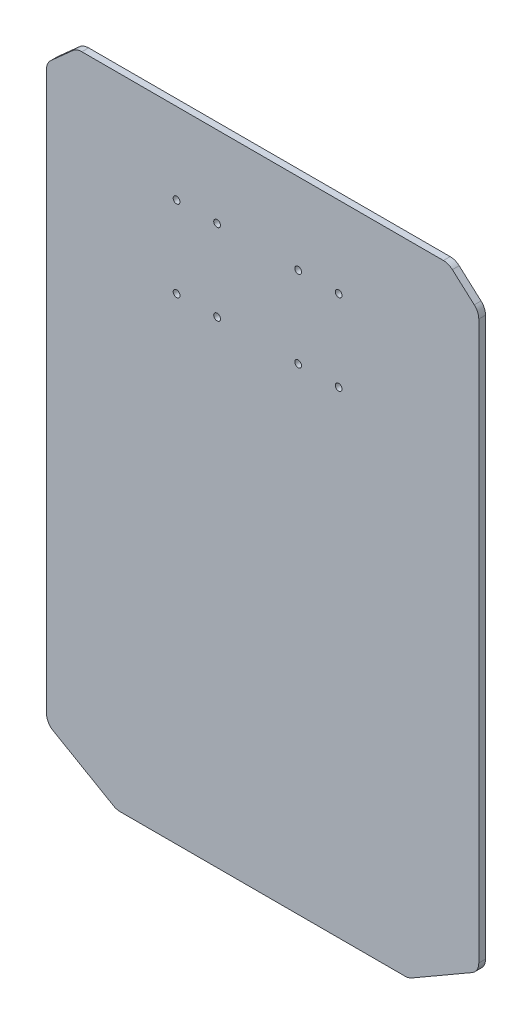
ISO-10303-21;
HEADER;
FILE_DESCRIPTION(('STEP AP214'),'2;1');
FILE_NAME('part.step','',(''),(''),'','','');
FILE_SCHEMA(('AUTOMOTIVE_DESIGN { 1 0 10303 214 1 1 1 1 }'));
ENDSEC;
DATA;
#1=APPLICATION_CONTEXT('core data for automotive mechanical design processes');
#2=APPLICATION_PROTOCOL_DEFINITION('international standard','automotive_design',2000,#1);
#3=PRODUCT_CONTEXT('',#1,'mechanical');
#4=PRODUCT('Part','Part','',(#3));
#5=PRODUCT_RELATED_PRODUCT_CATEGORY('part','',(#4));
#6=PRODUCT_DEFINITION_FORMATION('','',#4);
#7=PRODUCT_DEFINITION_CONTEXT('part definition',#1,'design');
#8=PRODUCT_DEFINITION('design','',#6,#7);
#9=PRODUCT_DEFINITION_SHAPE('','',#8);
#10=(LENGTH_UNIT() NAMED_UNIT(*) SI_UNIT(.MILLI.,.METRE.));
#11=(NAMED_UNIT(*) PLANE_ANGLE_UNIT() SI_UNIT($,.RADIAN.));
#12=(NAMED_UNIT(*) SI_UNIT($,.STERADIAN.) SOLID_ANGLE_UNIT());
#13=UNCERTAINTY_MEASURE_WITH_UNIT(LENGTH_MEASURE(1.E-05),#10,'distance_accuracy_value','');
#14=(GEOMETRIC_REPRESENTATION_CONTEXT(3) GLOBAL_UNCERTAINTY_ASSIGNED_CONTEXT((#13)) GLOBAL_UNIT_ASSIGNED_CONTEXT((#10,
#11,#12)) REPRESENTATION_CONTEXT('',''));
#15=CARTESIAN_POINT('',(0.,0.,0.));
#16=DIRECTION('',(0.,0.,1.));
#17=DIRECTION('',(1.,0.,0.));
#18=AXIS2_PLACEMENT_3D('',#15,#16,#17);
#19=CARTESIAN_POINT('',(163.695072606206,0.,5.));
#20=DIRECTION('',(1.,0.,0.));
#21=DIRECTION('',(0.,1.,0.));
#22=AXIS2_PLACEMENT_3D('',#19,#20,#21);
#23=PLANE('',#22);
#24=DIRECTION('',(0.,-1.,0.));
#25=VECTOR('',#24,1.);
#26=CARTESIAN_POINT('',(163.695072606206,0.,5.));
#27=LINE('',#26,#25);
#28=CARTESIAN_POINT('',(163.695072606206,212.027864045001,5.));
#29=VERTEX_POINT('',#28);
#30=CARTESIAN_POINT('',(163.695072606206,-200.726497308103,5.));
#31=VERTEX_POINT('',#30);
#32=EDGE_CURVE('E278',#29,#31,#27,.T.);
#33=ORIENTED_EDGE('',*,*,#32,.T.);
#34=DIRECTION('',(0.,0.,1.));
#35=VECTOR('',#34,1.);
#36=CARTESIAN_POINT('',(163.695072606206,-200.726497308103,0.));
#37=LINE('',#36,#35);
#38=CARTESIAN_POINT('',(163.695072606206,-200.726497308103,0.));
#39=VERTEX_POINT('',#38);
#40=EDGE_CURVE('E254',#31,#39,#37,.F.);
#41=ORIENTED_EDGE('',*,*,#40,.T.);
#42=DIRECTION('',(0.,-1.,0.));
#43=VECTOR('',#42,1.);
#44=CARTESIAN_POINT('',(163.695072606206,0.,0.));
#45=LINE('',#44,#43);
#46=CARTESIAN_POINT('',(163.695072606206,212.027864045001,0.));
#47=VERTEX_POINT('',#46);
#48=EDGE_CURVE('E193',#47,#39,#45,.T.);
#49=ORIENTED_EDGE('',*,*,#48,.F.);
#50=DIRECTION('',(0.,0.,1.));
#51=VECTOR('',#50,1.);
#52=CARTESIAN_POINT('',(163.695072606206,212.027864045001,5.));
#53=LINE('',#52,#51);
#54=EDGE_CURVE('E250',#47,#29,#53,.T.);
#55=ORIENTED_EDGE('',*,*,#54,.T.);
#56=EDGE_LOOP('',(#33,#41,#49,#55));
#57=FACE_BOUND('',#56,.T.);
#58=ADVANCED_FACE('F17',(#57),#23,.T.);
#59=CARTESIAN_POINT('',(3.69507260620591,236.5,5.));
#60=DIRECTION('',(0.,-1.,0.));
#61=DIRECTION('',(1.,0.,0.));
#62=AXIS2_PLACEMENT_3D('',#59,#60,#61);
#63=PLANE('',#62);
#64=DIRECTION('',(-1.,0.,0.));
#65=VECTOR('',#64,1.);
#66=CARTESIAN_POINT('',(3.69507260620591,236.5,0.));
#67=LINE('',#66,#65);
#68=CARTESIAN_POINT('',(137.514732718707,236.5,0.));
#69=VERTEX_POINT('',#68);
#70=CARTESIAN_POINT('',(-130.124587506295,236.5,0.));
#71=VERTEX_POINT('',#70);
#72=EDGE_CURVE('E174',#69,#71,#67,.T.);
#73=ORIENTED_EDGE('',*,*,#72,.T.);
#74=DIRECTION('',(0.,0.,1.));
#75=VECTOR('',#74,1.);
#76=CARTESIAN_POINT('',(-130.124587506295,236.5,5.));
#77=LINE('',#76,#75);
#78=CARTESIAN_POINT('',(-130.124587506295,236.5,5.));
#79=VERTEX_POINT('',#78);
#80=EDGE_CURVE('E181',#71,#79,#77,.T.);
#81=ORIENTED_EDGE('',*,*,#80,.T.);
#82=DIRECTION('',(-1.,0.,0.));
#83=VECTOR('',#82,1.);
#84=CARTESIAN_POINT('',(3.69507260620591,236.5,5.));
#85=LINE('',#84,#83);
#86=CARTESIAN_POINT('',(137.514732718707,236.5,5.));
#87=VERTEX_POINT('',#86);
#88=EDGE_CURVE('E177',#87,#79,#85,.T.);
#89=ORIENTED_EDGE('',*,*,#88,.F.);
#90=DIRECTION('',(0.,0.,1.));
#91=VECTOR('',#90,1.);
#92=CARTESIAN_POINT('',(137.514732718707,236.5,0.));
#93=LINE('',#92,#91);
#94=EDGE_CURVE('E170',#87,#69,#93,.F.);
#95=ORIENTED_EDGE('',*,*,#94,.T.);
#96=EDGE_LOOP('',(#73,#81,#89,#95));
#97=FACE_BOUND('',#96,.T.);
#98=ADVANCED_FACE('F172',(#97),#63,.F.);
#99=CARTESIAN_POINT('',(-156.304927393794,0.,5.));
#100=DIRECTION('',(1.,0.,0.));
#101=DIRECTION('',(0.,1.,0.));
#102=AXIS2_PLACEMENT_3D('',#99,#100,#101);
#103=PLANE('',#102);
#104=DIRECTION('',(0.,-1.,0.));
#105=VECTOR('',#104,1.);
#106=CARTESIAN_POINT('',(-156.304927393794,0.,5.));
#107=LINE('',#106,#105);
#108=CARTESIAN_POINT('',(-156.304927393794,212.027864045001,5.));
#109=VERTEX_POINT('',#108);
#110=CARTESIAN_POINT('',(-156.304927393794,-200.726497308104,5.));
#111=VERTEX_POINT('',#110);
#112=EDGE_CURVE('E291',#109,#111,#107,.T.);
#113=ORIENTED_EDGE('',*,*,#112,.F.);
#114=DIRECTION('',(0.,0.,1.));
#115=VECTOR('',#114,1.);
#116=CARTESIAN_POINT('',(-156.304927393794,212.027864045001,5.));
#117=LINE('',#116,#115);
#118=CARTESIAN_POINT('',(-156.304927393794,212.027864045001,0.));
#119=VERTEX_POINT('',#118);
#120=EDGE_CURVE('E227',#109,#119,#117,.F.);
#121=ORIENTED_EDGE('',*,*,#120,.T.);
#122=DIRECTION('',(0.,-1.,0.));
#123=VECTOR('',#122,1.);
#124=CARTESIAN_POINT('',(-156.304927393794,0.,0.));
#125=LINE('',#124,#123);
#126=CARTESIAN_POINT('',(-156.304927393794,-200.726497308104,0.));
#127=VERTEX_POINT('',#126);
#128=EDGE_CURVE('E192',#119,#127,#125,.T.);
#129=ORIENTED_EDGE('',*,*,#128,.T.);
#130=DIRECTION('',(0.,0.,1.));
#131=VECTOR('',#130,1.);
#132=CARTESIAN_POINT('',(-156.304927393794,-200.726497308104,5.));
#133=LINE('',#132,#131);
#134=EDGE_CURVE('E223',#127,#111,#133,.T.);
#135=ORIENTED_EDGE('',*,*,#134,.T.);
#136=EDGE_LOOP('',(#113,#121,#129,#135));
#137=FACE_BOUND('',#136,.T.);
#138=ADVANCED_FACE('F480',(#137),#103,.F.);
#139=CARTESIAN_POINT('',(3.69507260620591,-236.5,5.));
#140=DIRECTION('',(0.,-1.,0.));
#141=DIRECTION('',(1.,0.,0.));
#142=AXIS2_PLACEMENT_3D('',#139,#140,#141);
#143=PLANE('',#142);
#144=DIRECTION('',(-1.,0.,0.));
#145=VECTOR('',#144,1.);
#146=CARTESIAN_POINT('',(3.69507260620591,-236.5,5.));
#147=LINE('',#146,#145);
#148=CARTESIAN_POINT('',(109.054056454828,-236.5,5.));
#149=VERTEX_POINT('',#148);
#150=CARTESIAN_POINT('',(-101.663911242416,-236.5,5.));
#151=VERTEX_POINT('',#150);
#152=EDGE_CURVE('E271',#149,#151,#147,.T.);
#153=ORIENTED_EDGE('',*,*,#152,.T.);
#154=DIRECTION('',(0.,0.,1.));
#155=VECTOR('',#154,1.);
#156=CARTESIAN_POINT('',(-101.663911242416,-236.5,5.));
#157=LINE('',#156,#155);
#158=CARTESIAN_POINT('',(-101.663911242416,-236.5,0.));
#159=VERTEX_POINT('',#158);
#160=EDGE_CURVE('E240',#151,#159,#157,.F.);
#161=ORIENTED_EDGE('',*,*,#160,.T.);
#162=DIRECTION('',(-1.,0.,0.));
#163=VECTOR('',#162,1.);
#164=CARTESIAN_POINT('',(3.69507260620591,-236.5,0.));
#165=LINE('',#164,#163);
#166=CARTESIAN_POINT('',(109.054056454828,-236.5,0.));
#167=VERTEX_POINT('',#166);
#168=EDGE_CURVE('E285',#167,#159,#165,.T.);
#169=ORIENTED_EDGE('',*,*,#168,.F.);
#170=DIRECTION('',(0.,0.,1.));
#171=VECTOR('',#170,1.);
#172=CARTESIAN_POINT('',(109.054056454828,-236.5,5.));
#173=LINE('',#172,#171);
#174=EDGE_CURVE('E236',#167,#149,#173,.T.);
#175=ORIENTED_EDGE('',*,*,#174,.T.);
#176=EDGE_LOOP('',(#153,#161,#169,#175));
#177=FACE_BOUND('',#176,.T.);
#178=ADVANCED_FACE('F452',(#177),#143,.T.);
#179=CARTESIAN_POINT('',(3.69507260620589,0.,5.));
#180=DIRECTION('',(0.,0.,1.));
#181=DIRECTION('',(1.,0.,0.));
#182=AXIS2_PLACEMENT_3D('',#179,#180,#181);
#183=PLANE('',#182);
#184=CARTESIAN_POINT('',(-60.,176.5,5.));
#185=DIRECTION('',(0.,0.,1.));
#186=DIRECTION('',(1.,0.,0.));
#187=AXIS2_PLACEMENT_3D('',#184,#185,#186);
#188=CIRCLE('',#187,2.5);
#189=CARTESIAN_POINT('',(-57.5,176.5,5.));
#190=VERTEX_POINT('',#189);
#191=EDGE_CURVE('E409',#190,#190,#188,.T.);
#192=ORIENTED_EDGE('',*,*,#191,.F.);
#193=EDGE_LOOP('',(#192));
#194=FACE_BOUND('',#193,.T.);
#195=CARTESIAN_POINT('',(-30.,176.5,5.));
#196=DIRECTION('',(0.,0.,1.));
#197=DIRECTION('',(1.,0.,0.));
#198=AXIS2_PLACEMENT_3D('',#195,#196,#197);
#199=CIRCLE('',#198,2.5);
#200=CARTESIAN_POINT('',(-27.5,176.5,5.));
#201=VERTEX_POINT('',#200);
#202=EDGE_CURVE('E401',#201,#201,#199,.T.);
#203=ORIENTED_EDGE('',*,*,#202,.F.);
#204=EDGE_LOOP('',(#203));
#205=FACE_BOUND('',#204,.T.);
#206=CARTESIAN_POINT('',(-30.,116.5,5.));
#207=DIRECTION('',(0.,0.,1.));
#208=DIRECTION('',(1.,0.,0.));
#209=AXIS2_PLACEMENT_3D('',#206,#207,#208);
#210=CIRCLE('',#209,2.5);
#211=CARTESIAN_POINT('',(-27.5,116.5,5.));
#212=VERTEX_POINT('',#211);
#213=EDGE_CURVE('E393',#212,#212,#210,.T.);
#214=ORIENTED_EDGE('',*,*,#213,.F.);
#215=EDGE_LOOP('',(#214));
#216=FACE_BOUND('',#215,.T.);
#217=CARTESIAN_POINT('',(30.,116.5,5.));
#218=DIRECTION('',(0.,0.,1.));
#219=DIRECTION('',(1.,0.,0.));
#220=AXIS2_PLACEMENT_3D('',#217,#218,#219);
#221=CIRCLE('',#220,2.5);
#222=CARTESIAN_POINT('',(32.5,116.5,5.));
#223=VERTEX_POINT('',#222);
#224=EDGE_CURVE('E384',#223,#223,#221,.T.);
#225=ORIENTED_EDGE('',*,*,#224,.F.);
#226=EDGE_LOOP('',(#225));
#227=FACE_BOUND('',#226,.T.);
#228=CARTESIAN_POINT('',(60.,116.5,5.));
#229=DIRECTION('',(0.,0.,1.));
#230=DIRECTION('',(1.,0.,0.));
#231=AXIS2_PLACEMENT_3D('',#228,#229,#230);
#232=CIRCLE('',#231,2.5);
#233=CARTESIAN_POINT('',(62.5,116.5,5.));
#234=VERTEX_POINT('',#233);
#235=EDGE_CURVE('E431',#234,#234,#232,.T.);
#236=ORIENTED_EDGE('',*,*,#235,.F.);
#237=EDGE_LOOP('',(#236));
#238=FACE_BOUND('',#237,.T.);
#239=CARTESIAN_POINT('',(60.,176.5,5.));
#240=DIRECTION('',(0.,0.,1.));
#241=DIRECTION('',(1.,0.,0.));
#242=AXIS2_PLACEMENT_3D('',#239,#240,#241);
#243=CIRCLE('',#242,2.5);
#244=CARTESIAN_POINT('',(62.5,176.5,5.));
#245=VERTEX_POINT('',#244);
#246=EDGE_CURVE('E423',#245,#245,#243,.T.);
#247=ORIENTED_EDGE('',*,*,#246,.F.);
#248=EDGE_LOOP('',(#247));
#249=FACE_BOUND('',#248,.T.);
#250=CARTESIAN_POINT('',(30.,176.5,5.));
#251=DIRECTION('',(0.,0.,1.));
#252=DIRECTION('',(1.,0.,0.));
#253=AXIS2_PLACEMENT_3D('',#250,#251,#252);
#254=CIRCLE('',#253,2.5);
#255=CARTESIAN_POINT('',(32.5,176.5,5.));
#256=VERTEX_POINT('',#255);
#257=EDGE_CURVE('E415',#256,#256,#254,.T.);
#258=ORIENTED_EDGE('',*,*,#257,.F.);
#259=EDGE_LOOP('',(#258));
#260=FACE_BOUND('',#259,.T.);
#261=CARTESIAN_POINT('',(-60.,116.5,5.));
#262=DIRECTION('',(0.,0.,1.));
#263=DIRECTION('',(1.,0.,0.));
#264=AXIS2_PLACEMENT_3D('',#261,#262,#263);
#265=CIRCLE('',#264,2.5);
#266=CARTESIAN_POINT('',(-57.5,116.5,5.));
#267=VERTEX_POINT('',#266);
#268=EDGE_CURVE('E370',#267,#267,#265,.T.);
#269=ORIENTED_EDGE('',*,*,#268,.F.);
#270=EDGE_LOOP('',(#269));
#271=FACE_BOUND('',#270,.T.);
#272=ORIENTED_EDGE('',*,*,#88,.T.);
#273=CARTESIAN_POINT('',(-130.124587506295,226.5,5.));
#274=DIRECTION('',(0.,0.,1.));
#275=DIRECTION('',(1.,0.,0.));
#276=AXIS2_PLACEMENT_3D('',#273,#274,#275);
#277=CIRCLE('',#276,10.);
#278=CARTESIAN_POINT('',(-136.791254172962,233.953559924999,5.));
#279=VERTEX_POINT('',#278);
#280=EDGE_CURVE('E335',#79,#279,#277,.T.);
#281=ORIENTED_EDGE('',*,*,#280,.T.);
#282=DIRECTION('',(0.745355992499931,0.666666666666666,0.));
#283=VECTOR('',#282,1.);
#284=CARTESIAN_POINT('',(-145.124587506295,226.5,5.));
#285=LINE('',#284,#283);
#286=CARTESIAN_POINT('',(-152.97159406046,219.481423969999,5.));
#287=VERTEX_POINT('',#286);
#288=EDGE_CURVE('E350',#287,#279,#285,.T.);
#289=ORIENTED_EDGE('',*,*,#288,.F.);
#290=CARTESIAN_POINT('',(-146.304927393794,212.027864045001,5.));
#291=DIRECTION('',(0.,0.,1.));
#292=DIRECTION('',(1.,0.,0.));
#293=AXIS2_PLACEMENT_3D('',#290,#291,#292);
#294=CIRCLE('',#293,10.);
#295=EDGE_CURVE('E332',#287,#109,#294,.T.);
#296=ORIENTED_EDGE('',*,*,#295,.T.);
#297=ORIENTED_EDGE('',*,*,#112,.T.);
#298=CARTESIAN_POINT('',(-146.304927393794,-200.726497308104,5.));
#299=DIRECTION('',(0.,0.,1.));
#300=DIRECTION('',(1.,0.,0.));
#301=AXIS2_PLACEMENT_3D('',#298,#299,#300);
#302=CIRCLE('',#301,10.);
#303=CARTESIAN_POINT('',(-151.304927393794,-209.386751345948,5.));
#304=VERTEX_POINT('',#303);
#305=EDGE_CURVE('E326',#111,#304,#302,.T.);
#306=ORIENTED_EDGE('',*,*,#305,.T.);
#307=DIRECTION('',(0.866025403784439,-0.5,0.));
#308=VECTOR('',#307,1.);
#309=CARTESIAN_POINT('',(-130.324165280261,-221.5,5.));
#310=LINE('',#309,#308);
#311=CARTESIAN_POINT('',(-106.663911242416,-235.160254037845,5.));
#312=VERTEX_POINT('',#311);
#313=EDGE_CURVE('E362',#304,#312,#310,.T.);
#314=ORIENTED_EDGE('',*,*,#313,.T.);
#315=CARTESIAN_POINT('',(-101.663911242416,-226.5,5.));
#316=DIRECTION('',(0.,0.,1.));
#317=DIRECTION('',(1.,0.,0.));
#318=AXIS2_PLACEMENT_3D('',#315,#316,#317);
#319=CIRCLE('',#318,10.);
#320=EDGE_CURVE('E329',#312,#151,#319,.T.);
#321=ORIENTED_EDGE('',*,*,#320,.T.);
#322=ORIENTED_EDGE('',*,*,#152,.F.);
#323=CARTESIAN_POINT('',(109.054056454828,-226.5,5.));
#324=DIRECTION('',(0.,0.,1.));
#325=DIRECTION('',(1.,0.,0.));
#326=AXIS2_PLACEMENT_3D('',#323,#324,#325);
#327=CIRCLE('',#326,10.);
#328=CARTESIAN_POINT('',(114.054056454828,-235.160254037845,5.));
#329=VERTEX_POINT('',#328);
#330=EDGE_CURVE('E321',#149,#329,#327,.T.);
#331=ORIENTED_EDGE('',*,*,#330,.T.);
#332=DIRECTION('',(-0.866025403784439,-0.5,0.));
#333=VECTOR('',#332,1.);
#334=CARTESIAN_POINT('',(137.714310492673,-221.5,5.));
#335=LINE('',#334,#333);
#336=CARTESIAN_POINT('',(158.695072606206,-209.386751345948,5.));
#337=VERTEX_POINT('',#336);
#338=EDGE_CURVE('E356',#337,#329,#335,.T.);
#339=ORIENTED_EDGE('',*,*,#338,.F.);
#340=CARTESIAN_POINT('',(153.695072606206,-200.726497308103,5.));
#341=DIRECTION('',(0.,0.,1.));
#342=DIRECTION('',(1.,0.,0.));
#343=AXIS2_PLACEMENT_3D('',#340,#341,#342);
#344=CIRCLE('',#343,10.);
#345=EDGE_CURVE('E283',#337,#31,#344,.T.);
#346=ORIENTED_EDGE('',*,*,#345,.T.);
#347=ORIENTED_EDGE('',*,*,#32,.F.);
#348=CARTESIAN_POINT('',(153.695072606206,212.027864045001,5.));
#349=DIRECTION('',(0.,0.,1.));
#350=DIRECTION('',(1.,0.,0.));
#351=AXIS2_PLACEMENT_3D('',#348,#349,#350);
#352=CIRCLE('',#351,10.);
#353=CARTESIAN_POINT('',(160.361739272873,219.48142397,5.));
#354=VERTEX_POINT('',#353);
#355=EDGE_CURVE('E274',#29,#354,#352,.T.);
#356=ORIENTED_EDGE('',*,*,#355,.T.);
#357=DIRECTION('',(-0.745355992499931,0.666666666666665,0.));
#358=VECTOR('',#357,1.);
#359=CARTESIAN_POINT('',(152.514732718707,226.5,5.));
#360=LINE('',#359,#358);
#361=CARTESIAN_POINT('',(144.181399385374,233.953559924999,5.));
#362=VERTEX_POINT('',#361);
#363=EDGE_CURVE('E264',#354,#362,#360,.T.);
#364=ORIENTED_EDGE('',*,*,#363,.T.);
#365=CARTESIAN_POINT('',(137.514732718707,226.5,5.));
#366=DIRECTION('',(0.,0.,1.));
#367=DIRECTION('',(1.,0.,0.));
#368=AXIS2_PLACEMENT_3D('',#365,#366,#367);
#369=CIRCLE('',#368,10.);
#370=EDGE_CURVE('E319',#362,#87,#369,.T.);
#371=ORIENTED_EDGE('',*,*,#370,.T.);
#372=EDGE_LOOP('',(#272,#281,#289,#296,#297,#306,#314,#321,#322,#331,#339,#346,#347,#356,#364,#371));
#373=FACE_BOUND('',#372,.T.);
#374=ADVANCED_FACE('F281',(#194,#205,#216,#227,#238,#249,#260,#271,#373),#183,.T.);
#375=CARTESIAN_POINT('',(3.69507260620589,0.,0.));
#376=DIRECTION('',(0.,0.,1.));
#377=DIRECTION('',(1.,0.,0.));
#378=AXIS2_PLACEMENT_3D('',#375,#376,#377);
#379=PLANE('',#378);
#380=CARTESIAN_POINT('',(-60.,176.5,0.));
#381=DIRECTION('',(0.,0.,1.));
#382=DIRECTION('',(1.,0.,0.));
#383=AXIS2_PLACEMENT_3D('',#380,#381,#382);
#384=CIRCLE('',#383,2.5);
#385=CARTESIAN_POINT('',(-57.5,176.5,0.));
#386=VERTEX_POINT('',#385);
#387=EDGE_CURVE('E382',#386,#386,#384,.T.);
#388=ORIENTED_EDGE('',*,*,#387,.T.);
#389=EDGE_LOOP('',(#388));
#390=FACE_BOUND('',#389,.T.);
#391=CARTESIAN_POINT('',(-30.,176.5,0.));
#392=DIRECTION('',(0.,0.,1.));
#393=DIRECTION('',(1.,0.,0.));
#394=AXIS2_PLACEMENT_3D('',#391,#392,#393);
#395=CIRCLE('',#394,2.5);
#396=CARTESIAN_POINT('',(-27.5,176.5,0.));
#397=VERTEX_POINT('',#396);
#398=EDGE_CURVE('E405',#397,#397,#395,.T.);
#399=ORIENTED_EDGE('',*,*,#398,.T.);
#400=EDGE_LOOP('',(#399));
#401=FACE_BOUND('',#400,.T.);
#402=CARTESIAN_POINT('',(-30.,116.5,0.));
#403=DIRECTION('',(0.,0.,1.));
#404=DIRECTION('',(1.,0.,0.));
#405=AXIS2_PLACEMENT_3D('',#402,#403,#404);
#406=CIRCLE('',#405,2.5);
#407=CARTESIAN_POINT('',(-27.5,116.5,0.));
#408=VERTEX_POINT('',#407);
#409=EDGE_CURVE('E397',#408,#408,#406,.T.);
#410=ORIENTED_EDGE('',*,*,#409,.T.);
#411=EDGE_LOOP('',(#410));
#412=FACE_BOUND('',#411,.T.);
#413=CARTESIAN_POINT('',(30.,116.5,0.));
#414=DIRECTION('',(0.,0.,1.));
#415=DIRECTION('',(1.,0.,0.));
#416=AXIS2_PLACEMENT_3D('',#413,#414,#415);
#417=CIRCLE('',#416,2.5);
#418=CARTESIAN_POINT('',(32.5,116.5,0.));
#419=VERTEX_POINT('',#418);
#420=EDGE_CURVE('E388',#419,#419,#417,.T.);
#421=ORIENTED_EDGE('',*,*,#420,.T.);
#422=EDGE_LOOP('',(#421));
#423=FACE_BOUND('',#422,.T.);
#424=CARTESIAN_POINT('',(60.,116.5,0.));
#425=DIRECTION('',(0.,0.,1.));
#426=DIRECTION('',(1.,0.,0.));
#427=AXIS2_PLACEMENT_3D('',#424,#425,#426);
#428=CIRCLE('',#427,2.5);
#429=CARTESIAN_POINT('',(62.5,116.5,0.));
#430=VERTEX_POINT('',#429);
#431=EDGE_CURVE('E389',#430,#430,#428,.T.);
#432=ORIENTED_EDGE('',*,*,#431,.T.);
#433=EDGE_LOOP('',(#432));
#434=FACE_BOUND('',#433,.T.);
#435=CARTESIAN_POINT('',(60.,176.5,0.));
#436=DIRECTION('',(0.,0.,1.));
#437=DIRECTION('',(1.,0.,0.));
#438=AXIS2_PLACEMENT_3D('',#435,#436,#437);
#439=CIRCLE('',#438,2.5);
#440=CARTESIAN_POINT('',(62.5,176.5,0.));
#441=VERTEX_POINT('',#440);
#442=EDGE_CURVE('E427',#441,#441,#439,.T.);
#443=ORIENTED_EDGE('',*,*,#442,.T.);
#444=EDGE_LOOP('',(#443));
#445=FACE_BOUND('',#444,.T.);
#446=CARTESIAN_POINT('',(30.,176.5,0.));
#447=DIRECTION('',(0.,0.,1.));
#448=DIRECTION('',(1.,0.,0.));
#449=AXIS2_PLACEMENT_3D('',#446,#447,#448);
#450=CIRCLE('',#449,2.5);
#451=CARTESIAN_POINT('',(32.5,176.5,0.));
#452=VERTEX_POINT('',#451);
#453=EDGE_CURVE('E419',#452,#452,#450,.T.);
#454=ORIENTED_EDGE('',*,*,#453,.T.);
#455=EDGE_LOOP('',(#454));
#456=FACE_BOUND('',#455,.T.);
#457=CARTESIAN_POINT('',(-60.,116.5,0.));
#458=DIRECTION('',(0.,0.,1.));
#459=DIRECTION('',(1.,0.,0.));
#460=AXIS2_PLACEMENT_3D('',#457,#458,#459);
#461=CIRCLE('',#460,2.5);
#462=CARTESIAN_POINT('',(-57.5,116.5,0.));
#463=VERTEX_POINT('',#462);
#464=EDGE_CURVE('E372',#463,#463,#461,.T.);
#465=ORIENTED_EDGE('',*,*,#464,.T.);
#466=EDGE_LOOP('',(#465));
#467=FACE_BOUND('',#466,.T.);
#468=DIRECTION('',(0.745355992499931,0.666666666666666,0.));
#469=VECTOR('',#468,1.);
#470=CARTESIAN_POINT('',(-174.995753422395,199.782416977771,0.));
#471=LINE('',#470,#469);
#472=CARTESIAN_POINT('',(-152.971594060461,219.48142397,0.));
#473=VERTEX_POINT('',#472);
#474=CARTESIAN_POINT('',(-136.791254172962,233.953559924999,0.));
#475=VERTEX_POINT('',#474);
#476=EDGE_CURVE('E182',#473,#475,#471,.T.);
#477=ORIENTED_EDGE('',*,*,#476,.T.);
#478=CARTESIAN_POINT('',(-130.124587506295,226.5,0.));
#479=DIRECTION('',(0.,0.,1.));
#480=DIRECTION('',(1.,0.,0.));
#481=AXIS2_PLACEMENT_3D('',#478,#479,#480);
#482=CIRCLE('',#481,10.);
#483=EDGE_CURVE('E190',#475,#71,#482,.F.);
#484=ORIENTED_EDGE('',*,*,#483,.T.);
#485=ORIENTED_EDGE('',*,*,#72,.F.);
#486=CARTESIAN_POINT('',(137.514732718707,226.5,0.));
#487=DIRECTION('',(0.,0.,1.));
#488=DIRECTION('',(1.,0.,0.));
#489=AXIS2_PLACEMENT_3D('',#486,#487,#488);
#490=CIRCLE('',#489,10.);
#491=CARTESIAN_POINT('',(144.181399385374,233.953559924999,0.));
#492=VERTEX_POINT('',#491);
#493=EDGE_CURVE('E187',#69,#492,#490,.F.);
#494=ORIENTED_EDGE('',*,*,#493,.T.);
#495=DIRECTION('',(-0.745355992499931,0.666666666666665,0.));
#496=VECTOR('',#495,1.);
#497=CARTESIAN_POINT('',(182.385898634806,199.782416977771,0.));
#498=LINE('',#497,#496);
#499=CARTESIAN_POINT('',(160.361739272873,219.48142397,0.));
#500=VERTEX_POINT('',#499);
#501=EDGE_CURVE('E262',#500,#492,#498,.T.);
#502=ORIENTED_EDGE('',*,*,#501,.F.);
#503=CARTESIAN_POINT('',(153.695072606206,212.027864045001,0.));
#504=DIRECTION('',(0.,0.,1.));
#505=DIRECTION('',(1.,0.,0.));
#506=AXIS2_PLACEMENT_3D('',#503,#504,#505);
#507=CIRCLE('',#506,10.);
#508=EDGE_CURVE('E199',#500,#47,#507,.F.);
#509=ORIENTED_EDGE('',*,*,#508,.T.);
#510=ORIENTED_EDGE('',*,*,#48,.T.);
#511=CARTESIAN_POINT('',(153.695072606206,-200.726497308103,0.));
#512=DIRECTION('',(0.,0.,1.));
#513=DIRECTION('',(1.,0.,0.));
#514=AXIS2_PLACEMENT_3D('',#511,#512,#513);
#515=CIRCLE('',#514,10.);
#516=CARTESIAN_POINT('',(158.695072606206,-209.386751345948,0.));
#517=VERTEX_POINT('',#516);
#518=EDGE_CURVE('E204',#39,#517,#515,.F.);
#519=ORIENTED_EDGE('',*,*,#518,.T.);
#520=DIRECTION('',(-0.866025403784439,-0.5,0.));
#521=VECTOR('',#520,1.);
#522=CARTESIAN_POINT('',(133.112195546949,-224.157032302755,0.));
#523=LINE('',#522,#521);
#524=CARTESIAN_POINT('',(114.054056454828,-235.160254037845,0.));
#525=VERTEX_POINT('',#524);
#526=EDGE_CURVE('E270',#517,#525,#523,.T.);
#527=ORIENTED_EDGE('',*,*,#526,.T.);
#528=CARTESIAN_POINT('',(109.054056454828,-226.5,0.));
#529=DIRECTION('',(0.,0.,1.));
#530=DIRECTION('',(1.,0.,0.));
#531=AXIS2_PLACEMENT_3D('',#528,#529,#530);
#532=CIRCLE('',#531,10.);
#533=EDGE_CURVE('E198',#525,#167,#532,.F.);
#534=ORIENTED_EDGE('',*,*,#533,.T.);
#535=ORIENTED_EDGE('',*,*,#168,.T.);
#536=CARTESIAN_POINT('',(-101.663911242416,-226.5,0.));
#537=DIRECTION('',(0.,0.,1.));
#538=DIRECTION('',(1.,0.,0.));
#539=AXIS2_PLACEMENT_3D('',#536,#537,#538);
#540=CIRCLE('',#539,10.);
#541=CARTESIAN_POINT('',(-106.663911242416,-235.160254037845,0.));
#542=VERTEX_POINT('',#541);
#543=EDGE_CURVE('E38',#159,#542,#540,.F.);
#544=ORIENTED_EDGE('',*,*,#543,.T.);
#545=DIRECTION('',(0.866025403784439,-0.5,0.));
#546=VECTOR('',#545,1.);
#547=CARTESIAN_POINT('',(-125.722050334537,-224.157032302755,0.));
#548=LINE('',#547,#546);
#549=CARTESIAN_POINT('',(-151.304927393794,-209.386751345948,0.));
#550=VERTEX_POINT('',#549);
#551=EDGE_CURVE('E310',#550,#542,#548,.T.);
#552=ORIENTED_EDGE('',*,*,#551,.F.);
#553=CARTESIAN_POINT('',(-146.304927393794,-200.726497308104,0.));
#554=DIRECTION('',(0.,0.,1.));
#555=DIRECTION('',(1.,0.,0.));
#556=AXIS2_PLACEMENT_3D('',#553,#554,#555);
#557=CIRCLE('',#556,10.);
#558=EDGE_CURVE('E213',#550,#127,#557,.F.);
#559=ORIENTED_EDGE('',*,*,#558,.T.);
#560=ORIENTED_EDGE('',*,*,#128,.F.);
#561=CARTESIAN_POINT('',(-146.304927393794,212.027864045001,0.));
#562=DIRECTION('',(0.,0.,1.));
#563=DIRECTION('',(1.,0.,0.));
#564=AXIS2_PLACEMENT_3D('',#561,#562,#563);
#565=CIRCLE('',#564,10.);
#566=EDGE_CURVE('E218',#119,#473,#565,.F.);
#567=ORIENTED_EDGE('',*,*,#566,.T.);
#568=EDGE_LOOP('',(#477,#484,#485,#494,#502,#509,#510,#519,#527,#534,#535,#544,#552,#559,#560,#567));
#569=FACE_BOUND('',#568,.T.);
#570=ADVANCED_FACE('F185',(#390,#401,#412,#423,#434,#445,#456,#467,#569),#379,.F.);
#571=CARTESIAN_POINT('',(152.514732718707,226.5,-20.));
#572=DIRECTION('',(0.666666666666665,0.745355992499931,0.));
#573=DIRECTION('',(-0.745355992499931,0.666666666666665,0.));
#574=AXIS2_PLACEMENT_3D('',#571,#572,#573);
#575=PLANE('',#574);
#576=ORIENTED_EDGE('',*,*,#501,.T.);
#577=DIRECTION('',(0.,0.,1.));
#578=VECTOR('',#577,1.);
#579=CARTESIAN_POINT('',(144.181399385374,233.953559924999,5.));
#580=LINE('',#579,#578);
#581=EDGE_CURVE('E11',#492,#362,#580,.T.);
#582=ORIENTED_EDGE('',*,*,#581,.T.);
#583=ORIENTED_EDGE('',*,*,#363,.F.);
#584=DIRECTION('',(0.,0.,1.));
#585=VECTOR('',#584,1.);
#586=CARTESIAN_POINT('',(160.361739272873,219.48142397,-20.));
#587=LINE('',#586,#585);
#588=EDGE_CURVE('E26',#354,#500,#587,.F.);
#589=ORIENTED_EDGE('',*,*,#588,.T.);
#590=EDGE_LOOP('',(#576,#582,#583,#589));
#591=FACE_BOUND('',#590,.T.);
#592=ADVANCED_FACE('F261',(#591),#575,.T.);
#593=CARTESIAN_POINT('',(137.714310492673,-221.5,-20.));
#594=DIRECTION('',(-0.5,0.866025403784439,0.));
#595=DIRECTION('',(-0.866025403784439,-0.5,0.));
#596=AXIS2_PLACEMENT_3D('',#593,#594,#595);
#597=PLANE('',#596);
#598=ORIENTED_EDGE('',*,*,#526,.F.);
#599=DIRECTION('',(0.,0.,1.));
#600=VECTOR('',#599,1.);
#601=CARTESIAN_POINT('',(158.695072606206,-209.386751345948,5.));
#602=LINE('',#601,#600);
#603=EDGE_CURVE('E246',#517,#337,#602,.T.);
#604=ORIENTED_EDGE('',*,*,#603,.T.);
#605=ORIENTED_EDGE('',*,*,#338,.T.);
#606=DIRECTION('',(0.,0.,1.));
#607=VECTOR('',#606,1.);
#608=CARTESIAN_POINT('',(114.054056454828,-235.160254037845,0.));
#609=LINE('',#608,#607);
#610=EDGE_CURVE('E243',#329,#525,#609,.F.);
#611=ORIENTED_EDGE('',*,*,#610,.T.);
#612=EDGE_LOOP('',(#598,#604,#605,#611));
#613=FACE_BOUND('',#612,.T.);
#614=ADVANCED_FACE('F699',(#613),#597,.F.);
#615=CARTESIAN_POINT('',(-130.324165280261,-221.5,-20.));
#616=DIRECTION('',(-0.5,-0.866025403784439,0.));
#617=DIRECTION('',(0.866025403784439,-0.5,0.));
#618=AXIS2_PLACEMENT_3D('',#615,#616,#617);
#619=PLANE('',#618);
#620=ORIENTED_EDGE('',*,*,#551,.T.);
#621=DIRECTION('',(0.,0.,1.));
#622=VECTOR('',#621,1.);
#623=CARTESIAN_POINT('',(-106.663911242416,-235.160254037845,-20.));
#624=LINE('',#623,#622);
#625=EDGE_CURVE('E232',#542,#312,#624,.T.);
#626=ORIENTED_EDGE('',*,*,#625,.T.);
#627=ORIENTED_EDGE('',*,*,#313,.F.);
#628=DIRECTION('',(0.,0.,1.));
#629=VECTOR('',#628,1.);
#630=CARTESIAN_POINT('',(-151.304927393794,-209.386751345948,0.));
#631=LINE('',#630,#629);
#632=EDGE_CURVE('E49',#304,#550,#631,.F.);
#633=ORIENTED_EDGE('',*,*,#632,.T.);
#634=EDGE_LOOP('',(#620,#626,#627,#633));
#635=FACE_BOUND('',#634,.T.);
#636=ADVANCED_FACE('F687',(#635),#619,.T.);
#637=CARTESIAN_POINT('',(-145.124587506295,226.5,-20.));
#638=DIRECTION('',(0.666666666666666,-0.745355992499931,0.));
#639=DIRECTION('',(0.745355992499931,0.666666666666666,0.));
#640=AXIS2_PLACEMENT_3D('',#637,#638,#639);
#641=PLANE('',#640);
#642=ORIENTED_EDGE('',*,*,#288,.T.);
#643=DIRECTION('',(0.,0.,1.));
#644=VECTOR('',#643,1.);
#645=CARTESIAN_POINT('',(-136.791254172962,233.953559924999,-20.));
#646=LINE('',#645,#644);
#647=EDGE_CURVE('E207',#279,#475,#646,.F.);
#648=ORIENTED_EDGE('',*,*,#647,.T.);
#649=ORIENTED_EDGE('',*,*,#476,.F.);
#650=DIRECTION('',(0.,0.,1.));
#651=VECTOR('',#650,1.);
#652=CARTESIAN_POINT('',(-152.97159406046,219.481423969999,-20.));
#653=LINE('',#652,#651);
#654=EDGE_CURVE('E338',#473,#287,#653,.T.);
#655=ORIENTED_EDGE('',*,*,#654,.T.);
#656=EDGE_LOOP('',(#642,#648,#649,#655));
#657=FACE_BOUND('',#656,.T.);
#658=ADVANCED_FACE('F347',(#657),#641,.F.);
#659=CARTESIAN_POINT('',(-130.124587506295,226.5,5.));
#660=DIRECTION('',(0.,0.,1.));
#661=DIRECTION('',(1.,0.,0.));
#662=AXIS2_PLACEMENT_3D('',#659,#660,#661);
#663=CYLINDRICAL_SURFACE('',#662,10.);
#664=ORIENTED_EDGE('',*,*,#483,.F.);
#665=ORIENTED_EDGE('',*,*,#647,.F.);
#666=ORIENTED_EDGE('',*,*,#280,.F.);
#667=ORIENTED_EDGE('',*,*,#80,.F.);
#668=EDGE_LOOP('',(#664,#665,#666,#667));
#669=FACE_BOUND('',#668,.T.);
#670=ADVANCED_FACE('F354',(#669),#663,.T.);
#671=CARTESIAN_POINT('',(-146.304927393794,212.027864045001,-20.));
#672=DIRECTION('',(0.,0.,1.));
#673=DIRECTION('',(1.,0.,0.));
#674=AXIS2_PLACEMENT_3D('',#671,#672,#673);
#675=CYLINDRICAL_SURFACE('',#674,10.);
#676=ORIENTED_EDGE('',*,*,#566,.F.);
#677=ORIENTED_EDGE('',*,*,#120,.F.);
#678=ORIENTED_EDGE('',*,*,#295,.F.);
#679=ORIENTED_EDGE('',*,*,#654,.F.);
#680=EDGE_LOOP('',(#676,#677,#678,#679));
#681=FACE_BOUND('',#680,.T.);
#682=ADVANCED_FACE('F486',(#681),#675,.T.);
#683=CARTESIAN_POINT('',(-101.663911242416,-226.5,-20.));
#684=DIRECTION('',(0.,0.,1.));
#685=DIRECTION('',(1.,0.,0.));
#686=AXIS2_PLACEMENT_3D('',#683,#684,#685);
#687=CYLINDRICAL_SURFACE('',#686,10.);
#688=ORIENTED_EDGE('',*,*,#543,.F.);
#689=ORIENTED_EDGE('',*,*,#160,.F.);
#690=ORIENTED_EDGE('',*,*,#320,.F.);
#691=ORIENTED_EDGE('',*,*,#625,.F.);
#692=EDGE_LOOP('',(#688,#689,#690,#691));
#693=FACE_BOUND('',#692,.T.);
#694=ADVANCED_FACE('F489',(#693),#687,.T.);
#695=CARTESIAN_POINT('',(-146.304927393794,-200.726497308104,5.));
#696=DIRECTION('',(0.,0.,-1.));
#697=DIRECTION('',(-1.,0.,0.));
#698=AXIS2_PLACEMENT_3D('',#695,#696,#697);
#699=CYLINDRICAL_SURFACE('',#698,10.);
#700=ORIENTED_EDGE('',*,*,#558,.F.);
#701=ORIENTED_EDGE('',*,*,#632,.F.);
#702=ORIENTED_EDGE('',*,*,#305,.F.);
#703=ORIENTED_EDGE('',*,*,#134,.F.);
#704=EDGE_LOOP('',(#700,#701,#702,#703));
#705=FACE_BOUND('',#704,.T.);
#706=ADVANCED_FACE('F493',(#705),#699,.T.);
#707=CARTESIAN_POINT('',(153.695072606206,-200.726497308103,-20.));
#708=DIRECTION('',(0.,0.,-1.));
#709=DIRECTION('',(-1.,0.,0.));
#710=AXIS2_PLACEMENT_3D('',#707,#708,#709);
#711=CYLINDRICAL_SURFACE('',#710,10.);
#712=ORIENTED_EDGE('',*,*,#518,.F.);
#713=ORIENTED_EDGE('',*,*,#40,.F.);
#714=ORIENTED_EDGE('',*,*,#345,.F.);
#715=ORIENTED_EDGE('',*,*,#603,.F.);
#716=EDGE_LOOP('',(#712,#713,#714,#715));
#717=FACE_BOUND('',#716,.T.);
#718=ADVANCED_FACE('F497',(#717),#711,.T.);
#719=CARTESIAN_POINT('',(109.054056454828,-226.5,5.));
#720=DIRECTION('',(0.,0.,-1.));
#721=DIRECTION('',(-1.,0.,0.));
#722=AXIS2_PLACEMENT_3D('',#719,#720,#721);
#723=CYLINDRICAL_SURFACE('',#722,10.);
#724=ORIENTED_EDGE('',*,*,#533,.F.);
#725=ORIENTED_EDGE('',*,*,#610,.F.);
#726=ORIENTED_EDGE('',*,*,#330,.F.);
#727=ORIENTED_EDGE('',*,*,#174,.F.);
#728=EDGE_LOOP('',(#724,#725,#726,#727));
#729=FACE_BOUND('',#728,.T.);
#730=ADVANCED_FACE('F501',(#729),#723,.T.);
#731=CARTESIAN_POINT('',(137.514732718707,226.5,-20.));
#732=DIRECTION('',(0.,0.,-1.));
#733=DIRECTION('',(-1.,0.,0.));
#734=AXIS2_PLACEMENT_3D('',#731,#732,#733);
#735=CYLINDRICAL_SURFACE('',#734,10.);
#736=ORIENTED_EDGE('',*,*,#493,.F.);
#737=ORIENTED_EDGE('',*,*,#94,.F.);
#738=ORIENTED_EDGE('',*,*,#370,.F.);
#739=ORIENTED_EDGE('',*,*,#581,.F.);
#740=EDGE_LOOP('',(#736,#737,#738,#739));
#741=FACE_BOUND('',#740,.T.);
#742=ADVANCED_FACE('F196',(#741),#735,.T.);
#743=CARTESIAN_POINT('',(153.695072606206,212.027864045001,5.));
#744=DIRECTION('',(0.,0.,1.));
#745=DIRECTION('',(1.,0.,0.));
#746=AXIS2_PLACEMENT_3D('',#743,#744,#745);
#747=CYLINDRICAL_SURFACE('',#746,10.);
#748=ORIENTED_EDGE('',*,*,#508,.F.);
#749=ORIENTED_EDGE('',*,*,#588,.F.);
#750=ORIENTED_EDGE('',*,*,#355,.F.);
#751=ORIENTED_EDGE('',*,*,#54,.F.);
#752=EDGE_LOOP('',(#748,#749,#750,#751));
#753=FACE_BOUND('',#752,.T.);
#754=ADVANCED_FACE('F19',(#753),#747,.T.);
#755=CARTESIAN_POINT('',(-60.,116.5,0.));
#756=DIRECTION('',(0.,0.,1.));
#757=DIRECTION('',(1.,0.,0.));
#758=AXIS2_PLACEMENT_3D('',#755,#756,#757);
#759=CYLINDRICAL_SURFACE('',#758,2.5);
#760=ORIENTED_EDGE('',*,*,#464,.F.);
#761=EDGE_LOOP('',(#760));
#762=FACE_BOUND('',#761,.T.);
#763=ORIENTED_EDGE('',*,*,#268,.T.);
#764=EDGE_LOOP('',(#763));
#765=FACE_BOUND('',#764,.T.);
#766=ADVANCED_FACE('F461',(#762,#765),#759,.F.);
#767=CARTESIAN_POINT('',(30.,176.5,0.));
#768=DIRECTION('',(0.,0.,1.));
#769=DIRECTION('',(1.,0.,0.));
#770=AXIS2_PLACEMENT_3D('',#767,#768,#769);
#771=CYLINDRICAL_SURFACE('',#770,2.5);
#772=ORIENTED_EDGE('',*,*,#453,.F.);
#773=EDGE_LOOP('',(#772));
#774=FACE_BOUND('',#773,.T.);
#775=ORIENTED_EDGE('',*,*,#257,.T.);
#776=EDGE_LOOP('',(#775));
#777=FACE_BOUND('',#776,.T.);
#778=ADVANCED_FACE('F463',(#774,#777),#771,.F.);
#779=CARTESIAN_POINT('',(60.,176.5,0.));
#780=DIRECTION('',(0.,0.,1.));
#781=DIRECTION('',(1.,0.,0.));
#782=AXIS2_PLACEMENT_3D('',#779,#780,#781);
#783=CYLINDRICAL_SURFACE('',#782,2.5);
#784=ORIENTED_EDGE('',*,*,#442,.F.);
#785=EDGE_LOOP('',(#784));
#786=FACE_BOUND('',#785,.T.);
#787=ORIENTED_EDGE('',*,*,#246,.T.);
#788=EDGE_LOOP('',(#787));
#789=FACE_BOUND('',#788,.T.);
#790=ADVANCED_FACE('F446',(#786,#789),#783,.F.);
#791=CARTESIAN_POINT('',(60.,116.5,0.));
#792=DIRECTION('',(0.,0.,1.));
#793=DIRECTION('',(1.,0.,0.));
#794=AXIS2_PLACEMENT_3D('',#791,#792,#793);
#795=CYLINDRICAL_SURFACE('',#794,2.5);
#796=ORIENTED_EDGE('',*,*,#431,.F.);
#797=EDGE_LOOP('',(#796));
#798=FACE_BOUND('',#797,.T.);
#799=ORIENTED_EDGE('',*,*,#235,.T.);
#800=EDGE_LOOP('',(#799));
#801=FACE_BOUND('',#800,.T.);
#802=ADVANCED_FACE('F442',(#798,#801),#795,.F.);
#803=CARTESIAN_POINT('',(30.,116.5,0.));
#804=DIRECTION('',(0.,0.,1.));
#805=DIRECTION('',(1.,0.,0.));
#806=AXIS2_PLACEMENT_3D('',#803,#804,#805);
#807=CYLINDRICAL_SURFACE('',#806,2.5);
#808=ORIENTED_EDGE('',*,*,#420,.F.);
#809=EDGE_LOOP('',(#808));
#810=FACE_BOUND('',#809,.T.);
#811=ORIENTED_EDGE('',*,*,#224,.T.);
#812=EDGE_LOOP('',(#811));
#813=FACE_BOUND('',#812,.T.);
#814=ADVANCED_FACE('F445',(#810,#813),#807,.F.);
#815=CARTESIAN_POINT('',(-30.,116.5,0.));
#816=DIRECTION('',(0.,0.,1.));
#817=DIRECTION('',(1.,0.,0.));
#818=AXIS2_PLACEMENT_3D('',#815,#816,#817);
#819=CYLINDRICAL_SURFACE('',#818,2.5);
#820=ORIENTED_EDGE('',*,*,#409,.F.);
#821=EDGE_LOOP('',(#820));
#822=FACE_BOUND('',#821,.T.);
#823=ORIENTED_EDGE('',*,*,#213,.T.);
#824=EDGE_LOOP('',(#823));
#825=FACE_BOUND('',#824,.T.);
#826=ADVANCED_FACE('F558',(#822,#825),#819,.F.);
#827=CARTESIAN_POINT('',(-30.,176.5,0.));
#828=DIRECTION('',(0.,0.,1.));
#829=DIRECTION('',(1.,0.,0.));
#830=AXIS2_PLACEMENT_3D('',#827,#828,#829);
#831=CYLINDRICAL_SURFACE('',#830,2.5);
#832=ORIENTED_EDGE('',*,*,#398,.F.);
#833=EDGE_LOOP('',(#832));
#834=FACE_BOUND('',#833,.T.);
#835=ORIENTED_EDGE('',*,*,#202,.T.);
#836=EDGE_LOOP('',(#835));
#837=FACE_BOUND('',#836,.T.);
#838=ADVANCED_FACE('F568',(#834,#837),#831,.F.);
#839=CARTESIAN_POINT('',(-60.,176.5,0.));
#840=DIRECTION('',(0.,0.,1.));
#841=DIRECTION('',(1.,0.,0.));
#842=AXIS2_PLACEMENT_3D('',#839,#840,#841);
#843=CYLINDRICAL_SURFACE('',#842,2.5);
#844=ORIENTED_EDGE('',*,*,#387,.F.);
#845=EDGE_LOOP('',(#844));
#846=FACE_BOUND('',#845,.T.);
#847=ORIENTED_EDGE('',*,*,#191,.T.);
#848=EDGE_LOOP('',(#847));
#849=FACE_BOUND('',#848,.T.);
#850=ADVANCED_FACE('F579',(#846,#849),#843,.F.);
#851=CLOSED_SHELL('',(#58,#98,#138,#178,#374,#570,#592,#614,#636,#658,#670,#682,#694,#706,#718,
#730,#742,#754,#766,#778,#790,#802,#814,#826,#838,#850));
#852=MANIFOLD_SOLID_BREP('B1',#851);
#853=ADVANCED_BREP_SHAPE_REPRESENTATION('',(#18,#852),#14);
#854=SHAPE_DEFINITION_REPRESENTATION(#9,#853);
ENDSEC;
END-ISO-10303-21;
